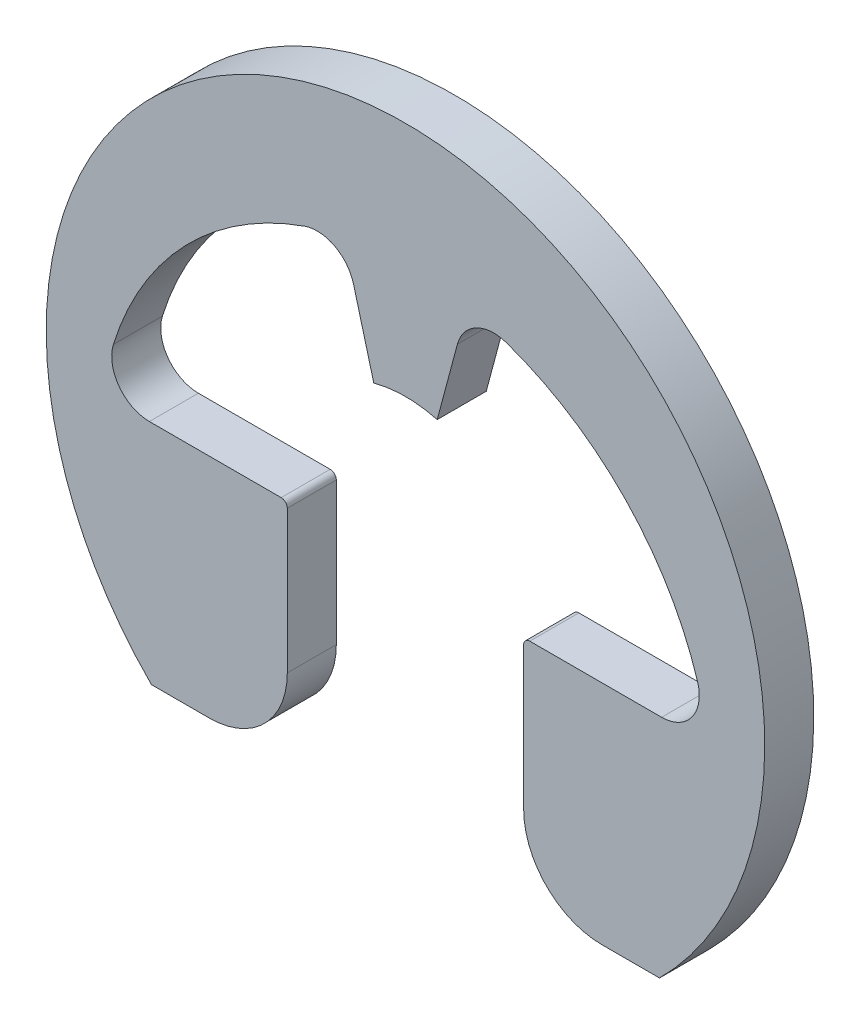
ISO-10303-21;
HEADER;
FILE_DESCRIPTION(('STEP AP214'),'2;1');
FILE_NAME('part.step','',(''),(''),'','','');
FILE_SCHEMA(('AUTOMOTIVE_DESIGN { 1 0 10303 214 1 1 1 1 }'));
ENDSEC;
DATA;
#1=APPLICATION_CONTEXT('core data for automotive mechanical design processes');
#2=APPLICATION_PROTOCOL_DEFINITION('international standard','automotive_design',2000,#1);
#3=PRODUCT_CONTEXT('',#1,'mechanical');
#4=PRODUCT('Part','Part','',(#3));
#5=PRODUCT_RELATED_PRODUCT_CATEGORY('part','',(#4));
#6=PRODUCT_DEFINITION_FORMATION('','',#4);
#7=PRODUCT_DEFINITION_CONTEXT('part definition',#1,'design');
#8=PRODUCT_DEFINITION('design','',#6,#7);
#9=PRODUCT_DEFINITION_SHAPE('','',#8);
#10=(LENGTH_UNIT() NAMED_UNIT(*) SI_UNIT(.MILLI.,.METRE.));
#11=(NAMED_UNIT(*) PLANE_ANGLE_UNIT() SI_UNIT($,.RADIAN.));
#12=(NAMED_UNIT(*) SI_UNIT($,.STERADIAN.) SOLID_ANGLE_UNIT());
#13=UNCERTAINTY_MEASURE_WITH_UNIT(LENGTH_MEASURE(1.E-05),#10,'distance_accuracy_value','');
#14=(GEOMETRIC_REPRESENTATION_CONTEXT(3) GLOBAL_UNCERTAINTY_ASSIGNED_CONTEXT((#13)) GLOBAL_UNIT_ASSIGNED_CONTEXT((#10,
#11,#12)) REPRESENTATION_CONTEXT('',''));
#15=CARTESIAN_POINT('',(0.,0.,0.));
#16=DIRECTION('',(0.,0.,1.));
#17=DIRECTION('',(1.,0.,0.));
#18=AXIS2_PLACEMENT_3D('',#15,#16,#17);
#19=CARTESIAN_POINT('',(-3.13455683202726,0.128222072929046,-0.6));
#20=DIRECTION('',(0.,0.,1.));
#21=DIRECTION('',(1.,0.,0.));
#22=AXIS2_PLACEMENT_3D('',#19,#20,#21);
#23=CYLINDRICAL_SURFACE('',#22,0.460862068965517);
#24=CARTESIAN_POINT('',(-3.13455683202726,0.128222072929046,0.));
#25=DIRECTION('',(0.,0.,-1.));
#26=DIRECTION('',(1.,0.,0.));
#27=AXIS2_PLACEMENT_3D('',#24,#25,#26);
#28=CIRCLE('',#27,0.460862068965517);
#29=CARTESIAN_POINT('',(-3.13455683202726,-0.332639996036471,0.));
#30=VERTEX_POINT('',#29);
#31=CARTESIAN_POINT('',(-3.57460913036127,0.265144756740484,0.));
#32=VERTEX_POINT('',#31);
#33=EDGE_CURVE('E201',#30,#32,#28,.T.);
#34=ORIENTED_EDGE('',*,*,#33,.F.);
#35=DIRECTION('',(0.,0.,1.));
#36=VECTOR('',#35,1.);
#37=CARTESIAN_POINT('',(-3.13455683202726,-0.332639996036471,-0.6));
#38=LINE('',#37,#36);
#39=CARTESIAN_POINT('',(-3.13455683202726,-0.332639996036471,-0.6));
#40=VERTEX_POINT('',#39);
#41=EDGE_CURVE('E11',#40,#30,#38,.T.);
#42=ORIENTED_EDGE('',*,*,#41,.F.);
#43=CARTESIAN_POINT('',(-3.13455683202726,0.128222072929046,-0.6));
#44=DIRECTION('',(0.,0.,-1.));
#45=DIRECTION('',(1.,0.,0.));
#46=AXIS2_PLACEMENT_3D('',#43,#44,#45);
#47=CIRCLE('',#46,0.460862068965517);
#48=CARTESIAN_POINT('',(-3.57460913036127,0.265144756740484,-0.6));
#49=VERTEX_POINT('',#48);
#50=EDGE_CURVE('E257',#40,#49,#47,.T.);
#51=ORIENTED_EDGE('',*,*,#50,.T.);
#52=DIRECTION('',(0.,0.,1.));
#53=VECTOR('',#52,1.);
#54=CARTESIAN_POINT('',(-3.57460913036127,0.265144756740484,-0.6));
#55=LINE('',#54,#53);
#56=EDGE_CURVE('E35',#49,#32,#55,.T.);
#57=ORIENTED_EDGE('',*,*,#56,.T.);
#58=EDGE_LOOP('',(#34,#42,#51,#57));
#59=FACE_BOUND('',#58,.T.);
#60=ADVANCED_FACE('F32',(#59),#23,.F.);
#61=CARTESIAN_POINT('',(-1.52133317640528,-0.332639996036471,-0.6));
#62=DIRECTION('',(0.,1.,0.));
#63=DIRECTION('',(-1.,0.,0.));
#64=AXIS2_PLACEMENT_3D('',#61,#62,#63);
#65=PLANE('',#64);
#66=DIRECTION('',(-1.,0.,0.));
#67=VECTOR('',#66,1.);
#68=CARTESIAN_POINT('',(-1.52133317640528,-0.332639996036471,0.));
#69=LINE('',#68,#67);
#70=CARTESIAN_POINT('',(-1.52133317640528,-0.332639996036471,0.));
#71=VERTEX_POINT('',#70);
#72=EDGE_CURVE('E255',#71,#30,#69,.T.);
#73=ORIENTED_EDGE('',*,*,#72,.F.);
#74=DIRECTION('',(0.,0.,1.));
#75=VECTOR('',#74,1.);
#76=CARTESIAN_POINT('',(-1.52133317640528,-0.332639996036471,-0.6));
#77=LINE('',#76,#75);
#78=CARTESIAN_POINT('',(-1.52133317640528,-0.332639996036471,-0.6));
#79=VERTEX_POINT('',#78);
#80=EDGE_CURVE('E41',#79,#71,#77,.T.);
#81=ORIENTED_EDGE('',*,*,#80,.F.);
#82=DIRECTION('',(-1.,0.,0.));
#83=VECTOR('',#82,1.);
#84=CARTESIAN_POINT('',(-1.52133317640528,-0.332639996036471,-0.6));
#85=LINE('',#84,#83);
#86=EDGE_CURVE('E191',#79,#40,#85,.T.);
#87=ORIENTED_EDGE('',*,*,#86,.T.);
#88=ORIENTED_EDGE('',*,*,#41,.T.);
#89=EDGE_LOOP('',(#73,#81,#87,#88));
#90=FACE_BOUND('',#89,.T.);
#91=ADVANCED_FACE('F293',(#90),#65,.T.);
#92=CARTESIAN_POINT('',(-1.52133317640528,-0.407639996036471,-0.6));
#93=DIRECTION('',(0.,0.,1.));
#94=DIRECTION('',(1.,0.,0.));
#95=AXIS2_PLACEMENT_3D('',#92,#93,#94);
#96=CYLINDRICAL_SURFACE('',#95,0.0750000000000002);
#97=CARTESIAN_POINT('',(-1.52133317640528,-0.407639996036471,0.));
#98=DIRECTION('',(0.,0.,1.));
#99=DIRECTION('',(1.,0.,0.));
#100=AXIS2_PLACEMENT_3D('',#97,#98,#99);
#101=CIRCLE('',#100,0.0750000000000002);
#102=CARTESIAN_POINT('',(-1.44633317640528,-0.407639996036471,0.));
#103=VERTEX_POINT('',#102);
#104=EDGE_CURVE('E178',#103,#71,#101,.T.);
#105=ORIENTED_EDGE('',*,*,#104,.F.);
#106=DIRECTION('',(0.,0.,1.));
#107=VECTOR('',#106,1.);
#108=CARTESIAN_POINT('',(-1.44633317640528,-0.407639996036471,-0.6));
#109=LINE('',#108,#107);
#110=CARTESIAN_POINT('',(-1.44633317640528,-0.407639996036471,-0.6));
#111=VERTEX_POINT('',#110);
#112=EDGE_CURVE('E173',#111,#103,#109,.T.);
#113=ORIENTED_EDGE('',*,*,#112,.F.);
#114=CARTESIAN_POINT('',(-1.52133317640528,-0.407639996036471,-0.6));
#115=DIRECTION('',(0.,0.,1.));
#116=DIRECTION('',(1.,0.,0.));
#117=AXIS2_PLACEMENT_3D('',#114,#115,#116);
#118=CIRCLE('',#117,0.0750000000000002);
#119=EDGE_CURVE('E176',#111,#79,#118,.T.);
#120=ORIENTED_EDGE('',*,*,#119,.T.);
#121=ORIENTED_EDGE('',*,*,#80,.T.);
#122=EDGE_LOOP('',(#105,#113,#120,#121));
#123=FACE_BOUND('',#122,.T.);
#124=ADVANCED_FACE('F175',(#123),#96,.T.);
#125=CARTESIAN_POINT('',(-1.44633317640528,-0.407639996036471,-0.6));
#126=DIRECTION('',(1.,0.,0.));
#127=DIRECTION('',(0.,0.,-1.));
#128=AXIS2_PLACEMENT_3D('',#125,#126,#127);
#129=PLANE('',#128);
#130=DIRECTION('',(0.,1.,0.));
#131=VECTOR('',#130,1.);
#132=CARTESIAN_POINT('',(-1.44633317640528,-0.407639996036471,0.));
#133=LINE('',#132,#131);
#134=CARTESIAN_POINT('',(-1.44633317640528,-2.15296946900982,0.));
#135=VERTEX_POINT('',#134);
#136=EDGE_CURVE('E252',#135,#103,#133,.T.);
#137=ORIENTED_EDGE('',*,*,#136,.F.);
#138=DIRECTION('',(0.,0.,1.));
#139=VECTOR('',#138,1.);
#140=CARTESIAN_POINT('',(-1.44633317640528,-2.15296946900982,-0.6));
#141=LINE('',#140,#139);
#142=CARTESIAN_POINT('',(-1.44633317640528,-2.15296946900982,-0.6));
#143=VERTEX_POINT('',#142);
#144=EDGE_CURVE('E183',#143,#135,#141,.T.);
#145=ORIENTED_EDGE('',*,*,#144,.F.);
#146=DIRECTION('',(0.,1.,0.));
#147=VECTOR('',#146,1.);
#148=CARTESIAN_POINT('',(-1.44633317640528,-0.407639996036471,-0.6));
#149=LINE('',#148,#147);
#150=EDGE_CURVE('E189',#143,#111,#149,.T.);
#151=ORIENTED_EDGE('',*,*,#150,.T.);
#152=ORIENTED_EDGE('',*,*,#112,.T.);
#153=EDGE_LOOP('',(#137,#145,#151,#152));
#154=FACE_BOUND('',#153,.T.);
#155=ADVANCED_FACE('F193',(#154),#129,.T.);
#156=CARTESIAN_POINT('',(-2.4021952453708,-2.15296946900982,-0.6));
#157=DIRECTION('',(0.,0.,1.));
#158=DIRECTION('',(1.,0.,0.));
#159=AXIS2_PLACEMENT_3D('',#156,#157,#158);
#160=CYLINDRICAL_SURFACE('',#159,0.955862068965517);
#161=CARTESIAN_POINT('',(-2.4021952453708,-2.15296946900982,0.));
#162=DIRECTION('',(0.,0.,1.));
#163=DIRECTION('',(1.,0.,0.));
#164=AXIS2_PLACEMENT_3D('',#161,#162,#163);
#165=CIRCLE('',#164,0.955862068965517);
#166=CARTESIAN_POINT('',(-2.4021952453708,-3.10883153797534,0.));
#167=VERTEX_POINT('',#166);
#168=EDGE_CURVE('E249',#167,#135,#165,.T.);
#169=ORIENTED_EDGE('',*,*,#168,.F.);
#170=DIRECTION('',(0.,0.,1.));
#171=VECTOR('',#170,1.);
#172=CARTESIAN_POINT('',(-2.4021952453708,-3.10883153797534,-0.6));
#173=LINE('',#172,#171);
#174=CARTESIAN_POINT('',(-2.4021952453708,-3.10883153797534,-0.6));
#175=VERTEX_POINT('',#174);
#176=EDGE_CURVE('E261',#175,#167,#173,.T.);
#177=ORIENTED_EDGE('',*,*,#176,.F.);
#178=CARTESIAN_POINT('',(-2.4021952453708,-2.15296946900982,-0.6));
#179=DIRECTION('',(0.,0.,1.));
#180=DIRECTION('',(1.,0.,0.));
#181=AXIS2_PLACEMENT_3D('',#178,#179,#180);
#182=CIRCLE('',#181,0.955862068965517);
#183=EDGE_CURVE('E194',#175,#143,#182,.T.);
#184=ORIENTED_EDGE('',*,*,#183,.T.);
#185=ORIENTED_EDGE('',*,*,#144,.T.);
#186=EDGE_LOOP('',(#169,#177,#184,#185));
#187=FACE_BOUND('',#186,.T.);
#188=ADVANCED_FACE('F306',(#187),#160,.T.);
#189=CARTESIAN_POINT('',(-2.4021952453708,-3.10883153797534,-0.6));
#190=DIRECTION('',(0.,-1.,0.));
#191=DIRECTION('',(1.,0.,0.));
#192=AXIS2_PLACEMENT_3D('',#189,#190,#191);
#193=PLANE('',#192);
#194=DIRECTION('',(1.,0.,0.));
#195=VECTOR('',#194,1.);
#196=CARTESIAN_POINT('',(-2.4021952453708,-3.10883153797534,0.));
#197=LINE('',#196,#195);
#198=CARTESIAN_POINT('',(-3.10883153797534,-3.10883153797534,0.));
#199=VERTEX_POINT('',#198);
#200=EDGE_CURVE('E246',#199,#167,#197,.T.);
#201=ORIENTED_EDGE('',*,*,#200,.F.);
#202=DIRECTION('',(0.,0.,1.));
#203=VECTOR('',#202,1.);
#204=CARTESIAN_POINT('',(-3.10883153797534,-3.10883153797534,-0.6));
#205=LINE('',#204,#203);
#206=CARTESIAN_POINT('',(-3.10883153797534,-3.10883153797534,-0.6));
#207=VERTEX_POINT('',#206);
#208=EDGE_CURVE('E263',#207,#199,#205,.T.);
#209=ORIENTED_EDGE('',*,*,#208,.F.);
#210=DIRECTION('',(1.,0.,0.));
#211=VECTOR('',#210,1.);
#212=CARTESIAN_POINT('',(-2.4021952453708,-3.10883153797534,-0.6));
#213=LINE('',#212,#211);
#214=EDGE_CURVE('E196',#207,#175,#213,.T.);
#215=ORIENTED_EDGE('',*,*,#214,.T.);
#216=ORIENTED_EDGE('',*,*,#176,.T.);
#217=EDGE_LOOP('',(#201,#209,#215,#216));
#218=FACE_BOUND('',#217,.T.);
#219=ADVANCED_FACE('F309',(#218),#193,.T.);
#220=CARTESIAN_POINT('',(0.,0.,-0.6));
#221=DIRECTION('',(0.,0.,1.));
#222=DIRECTION('',(1.,0.,0.));
#223=AXIS2_PLACEMENT_3D('',#220,#221,#222);
#224=CYLINDRICAL_SURFACE('',#223,4.39655172413793);
#225=CARTESIAN_POINT('',(0.,0.,0.));
#226=DIRECTION('',(0.,0.,1.));
#227=DIRECTION('',(1.,0.,0.));
#228=AXIS2_PLACEMENT_3D('',#225,#226,#227);
#229=CIRCLE('',#228,4.39655172413793);
#230=CARTESIAN_POINT('',(3.10883153797534,-3.10883153797534,0.));
#231=VERTEX_POINT('',#230);
#232=EDGE_CURVE('E243',#231,#199,#229,.T.);
#233=ORIENTED_EDGE('',*,*,#232,.F.);
#234=DIRECTION('',(0.,0.,1.));
#235=VECTOR('',#234,1.);
#236=CARTESIAN_POINT('',(3.10883153797534,-3.10883153797534,-0.6));
#237=LINE('',#236,#235);
#238=CARTESIAN_POINT('',(3.10883153797534,-3.10883153797534,-0.6));
#239=VERTEX_POINT('',#238);
#240=EDGE_CURVE('E265',#239,#231,#237,.T.);
#241=ORIENTED_EDGE('',*,*,#240,.F.);
#242=CARTESIAN_POINT('',(0.,0.,-0.6));
#243=DIRECTION('',(0.,0.,1.));
#244=DIRECTION('',(1.,0.,0.));
#245=AXIS2_PLACEMENT_3D('',#242,#243,#244);
#246=CIRCLE('',#245,4.39655172413793);
#247=EDGE_CURVE('E548',#239,#207,#246,.T.);
#248=ORIENTED_EDGE('',*,*,#247,.T.);
#249=ORIENTED_EDGE('',*,*,#208,.T.);
#250=EDGE_LOOP('',(#233,#241,#248,#249));
#251=FACE_BOUND('',#250,.T.);
#252=ADVANCED_FACE('F313',(#251),#224,.T.);
#253=CARTESIAN_POINT('',(3.10883153797534,-3.10883153797534,-0.6));
#254=DIRECTION('',(0.,-1.,0.));
#255=DIRECTION('',(0.,0.,-1.));
#256=AXIS2_PLACEMENT_3D('',#253,#254,#255);
#257=PLANE('',#256);
#258=DIRECTION('',(1.,0.,0.));
#259=VECTOR('',#258,1.);
#260=CARTESIAN_POINT('',(3.10883153797534,-3.10883153797534,0.));
#261=LINE('',#260,#259);
#262=CARTESIAN_POINT('',(2.4021952453708,-3.10883153797534,0.));
#263=VERTEX_POINT('',#262);
#264=EDGE_CURVE('E240',#263,#231,#261,.T.);
#265=ORIENTED_EDGE('',*,*,#264,.F.);
#266=DIRECTION('',(0.,0.,1.));
#267=VECTOR('',#266,1.);
#268=CARTESIAN_POINT('',(2.4021952453708,-3.10883153797534,-0.6));
#269=LINE('',#268,#267);
#270=CARTESIAN_POINT('',(2.4021952453708,-3.10883153797534,-0.6));
#271=VERTEX_POINT('',#270);
#272=EDGE_CURVE('E267',#271,#263,#269,.T.);
#273=ORIENTED_EDGE('',*,*,#272,.F.);
#274=DIRECTION('',(1.,0.,0.));
#275=VECTOR('',#274,1.);
#276=CARTESIAN_POINT('',(3.10883153797534,-3.10883153797534,-0.6));
#277=LINE('',#276,#275);
#278=EDGE_CURVE('E541',#271,#239,#277,.T.);
#279=ORIENTED_EDGE('',*,*,#278,.T.);
#280=ORIENTED_EDGE('',*,*,#240,.T.);
#281=EDGE_LOOP('',(#265,#273,#279,#280));
#282=FACE_BOUND('',#281,.T.);
#283=ADVANCED_FACE('F317',(#282),#257,.T.);
#284=CARTESIAN_POINT('',(2.4021952453708,-2.15296946900982,-0.6));
#285=DIRECTION('',(0.,0.,1.));
#286=DIRECTION('',(1.,0.,0.));
#287=AXIS2_PLACEMENT_3D('',#284,#285,#286);
#288=CYLINDRICAL_SURFACE('',#287,0.955862068965517);
#289=CARTESIAN_POINT('',(2.4021952453708,-2.15296946900982,0.));
#290=DIRECTION('',(0.,0.,1.));
#291=DIRECTION('',(1.,0.,0.));
#292=AXIS2_PLACEMENT_3D('',#289,#290,#291);
#293=CIRCLE('',#292,0.955862068965517);
#294=CARTESIAN_POINT('',(1.44633317640528,-2.15296946900982,0.));
#295=VERTEX_POINT('',#294);
#296=EDGE_CURVE('E237',#295,#263,#293,.T.);
#297=ORIENTED_EDGE('',*,*,#296,.F.);
#298=DIRECTION('',(0.,0.,1.));
#299=VECTOR('',#298,1.);
#300=CARTESIAN_POINT('',(1.44633317640528,-2.15296946900982,-0.6));
#301=LINE('',#300,#299);
#302=CARTESIAN_POINT('',(1.44633317640528,-2.15296946900982,-0.6));
#303=VERTEX_POINT('',#302);
#304=EDGE_CURVE('E269',#303,#295,#301,.T.);
#305=ORIENTED_EDGE('',*,*,#304,.F.);
#306=CARTESIAN_POINT('',(2.4021952453708,-2.15296946900982,-0.6));
#307=DIRECTION('',(0.,0.,1.));
#308=DIRECTION('',(1.,0.,0.));
#309=AXIS2_PLACEMENT_3D('',#306,#307,#308);
#310=CIRCLE('',#309,0.955862068965517);
#311=EDGE_CURVE('E537',#303,#271,#310,.T.);
#312=ORIENTED_EDGE('',*,*,#311,.T.);
#313=ORIENTED_EDGE('',*,*,#272,.T.);
#314=EDGE_LOOP('',(#297,#305,#312,#313));
#315=FACE_BOUND('',#314,.T.);
#316=ADVANCED_FACE('F321',(#315),#288,.T.);
#317=CARTESIAN_POINT('',(1.44633317640528,-0.407639996036471,-0.6));
#318=DIRECTION('',(-1.,0.,0.));
#319=DIRECTION('',(0.,0.,1.));
#320=AXIS2_PLACEMENT_3D('',#317,#318,#319);
#321=PLANE('',#320);
#322=DIRECTION('',(0.,-1.,0.));
#323=VECTOR('',#322,1.);
#324=CARTESIAN_POINT('',(1.44633317640528,-0.407639996036471,0.));
#325=LINE('',#324,#323);
#326=CARTESIAN_POINT('',(1.44633317640528,-0.407639996036471,0.));
#327=VERTEX_POINT('',#326);
#328=EDGE_CURVE('E234',#327,#295,#325,.T.);
#329=ORIENTED_EDGE('',*,*,#328,.F.);
#330=DIRECTION('',(0.,0.,1.));
#331=VECTOR('',#330,1.);
#332=CARTESIAN_POINT('',(1.44633317640528,-0.407639996036471,-0.6));
#333=LINE('',#332,#331);
#334=CARTESIAN_POINT('',(1.44633317640528,-0.407639996036471,-0.6));
#335=VERTEX_POINT('',#334);
#336=EDGE_CURVE('E271',#335,#327,#333,.T.);
#337=ORIENTED_EDGE('',*,*,#336,.F.);
#338=DIRECTION('',(0.,-1.,0.));
#339=VECTOR('',#338,1.);
#340=CARTESIAN_POINT('',(1.44633317640528,-0.407639996036471,-0.6));
#341=LINE('',#340,#339);
#342=EDGE_CURVE('E553',#335,#303,#341,.T.);
#343=ORIENTED_EDGE('',*,*,#342,.T.);
#344=ORIENTED_EDGE('',*,*,#304,.T.);
#345=EDGE_LOOP('',(#329,#337,#343,#344));
#346=FACE_BOUND('',#345,.T.);
#347=ADVANCED_FACE('F325',(#346),#321,.T.);
#348=CARTESIAN_POINT('',(1.52133317640528,-0.407639996036471,-0.6));
#349=DIRECTION('',(0.,0.,1.));
#350=DIRECTION('',(1.,0.,0.));
#351=AXIS2_PLACEMENT_3D('',#348,#349,#350);
#352=CYLINDRICAL_SURFACE('',#351,0.0750000000000002);
#353=CARTESIAN_POINT('',(1.52133317640528,-0.407639996036471,0.));
#354=DIRECTION('',(0.,0.,1.));
#355=DIRECTION('',(1.,0.,0.));
#356=AXIS2_PLACEMENT_3D('',#353,#354,#355);
#357=CIRCLE('',#356,0.0750000000000002);
#358=CARTESIAN_POINT('',(1.52133317640528,-0.332639996036471,0.));
#359=VERTEX_POINT('',#358);
#360=EDGE_CURVE('E231',#359,#327,#357,.T.);
#361=ORIENTED_EDGE('',*,*,#360,.F.);
#362=DIRECTION('',(0.,0.,1.));
#363=VECTOR('',#362,1.);
#364=CARTESIAN_POINT('',(1.52133317640528,-0.332639996036471,-0.6));
#365=LINE('',#364,#363);
#366=CARTESIAN_POINT('',(1.52133317640528,-0.332639996036471,-0.6));
#367=VERTEX_POINT('',#366);
#368=EDGE_CURVE('E273',#367,#359,#365,.T.);
#369=ORIENTED_EDGE('',*,*,#368,.F.);
#370=CARTESIAN_POINT('',(1.52133317640528,-0.407639996036471,-0.6));
#371=DIRECTION('',(0.,0.,1.));
#372=DIRECTION('',(1.,0.,0.));
#373=AXIS2_PLACEMENT_3D('',#370,#371,#372);
#374=CIRCLE('',#373,0.0750000000000002);
#375=EDGE_CURVE('E530',#367,#335,#374,.T.);
#376=ORIENTED_EDGE('',*,*,#375,.T.);
#377=ORIENTED_EDGE('',*,*,#336,.T.);
#378=EDGE_LOOP('',(#361,#369,#376,#377));
#379=FACE_BOUND('',#378,.T.);
#380=ADVANCED_FACE('F329',(#379),#352,.T.);
#381=CARTESIAN_POINT('',(1.52133317640528,-0.332639996036471,-0.6));
#382=DIRECTION('',(0.,1.,0.));
#383=DIRECTION('',(0.,0.,1.));
#384=AXIS2_PLACEMENT_3D('',#381,#382,#383);
#385=PLANE('',#384);
#386=DIRECTION('',(-1.,0.,0.));
#387=VECTOR('',#386,1.);
#388=CARTESIAN_POINT('',(1.52133317640528,-0.332639996036471,0.));
#389=LINE('',#388,#387);
#390=CARTESIAN_POINT('',(3.13455683202726,-0.332639996036471,0.));
#391=VERTEX_POINT('',#390);
#392=EDGE_CURVE('E228',#391,#359,#389,.T.);
#393=ORIENTED_EDGE('',*,*,#392,.F.);
#394=DIRECTION('',(0.,0.,1.));
#395=VECTOR('',#394,1.);
#396=CARTESIAN_POINT('',(3.13455683202726,-0.332639996036471,-0.6));
#397=LINE('',#396,#395);
#398=CARTESIAN_POINT('',(3.13455683202726,-0.332639996036471,-0.6));
#399=VERTEX_POINT('',#398);
#400=EDGE_CURVE('E275',#399,#391,#397,.T.);
#401=ORIENTED_EDGE('',*,*,#400,.F.);
#402=DIRECTION('',(-1.,0.,0.));
#403=VECTOR('',#402,1.);
#404=CARTESIAN_POINT('',(1.52133317640528,-0.332639996036471,-0.6));
#405=LINE('',#404,#403);
#406=EDGE_CURVE('E526',#399,#367,#405,.T.);
#407=ORIENTED_EDGE('',*,*,#406,.T.);
#408=ORIENTED_EDGE('',*,*,#368,.T.);
#409=EDGE_LOOP('',(#393,#401,#407,#408));
#410=FACE_BOUND('',#409,.T.);
#411=ADVANCED_FACE('F333',(#410),#385,.T.);
#412=CARTESIAN_POINT('',(3.13455683202726,0.128222072929046,-0.6));
#413=DIRECTION('',(0.,0.,1.));
#414=DIRECTION('',(1.,0.,0.));
#415=AXIS2_PLACEMENT_3D('',#412,#413,#414);
#416=CYLINDRICAL_SURFACE('',#415,0.460862068965517);
#417=CARTESIAN_POINT('',(3.13455683202726,0.128222072929046,0.));
#418=DIRECTION('',(0.,0.,-1.));
#419=DIRECTION('',(1.,0.,0.));
#420=AXIS2_PLACEMENT_3D('',#417,#418,#419);
#421=CIRCLE('',#420,0.460862068965517);
#422=CARTESIAN_POINT('',(3.57460913036127,0.265144756740484,0.));
#423=VERTEX_POINT('',#422);
#424=EDGE_CURVE('E225',#423,#391,#421,.T.);
#425=ORIENTED_EDGE('',*,*,#424,.F.);
#426=DIRECTION('',(0.,0.,1.));
#427=VECTOR('',#426,1.);
#428=CARTESIAN_POINT('',(3.57460913036127,0.265144756740484,-0.6));
#429=LINE('',#428,#427);
#430=CARTESIAN_POINT('',(3.57460913036127,0.265144756740484,-0.6));
#431=VERTEX_POINT('',#430);
#432=EDGE_CURVE('E277',#431,#423,#429,.T.);
#433=ORIENTED_EDGE('',*,*,#432,.F.);
#434=CARTESIAN_POINT('',(3.13455683202726,0.128222072929046,-0.6));
#435=DIRECTION('',(0.,0.,-1.));
#436=DIRECTION('',(1.,0.,0.));
#437=AXIS2_PLACEMENT_3D('',#434,#435,#436);
#438=CIRCLE('',#437,0.460862068965517);
#439=EDGE_CURVE('E557',#431,#399,#438,.T.);
#440=ORIENTED_EDGE('',*,*,#439,.T.);
#441=ORIENTED_EDGE('',*,*,#400,.T.);
#442=EDGE_LOOP('',(#425,#433,#440,#441));
#443=FACE_BOUND('',#442,.T.);
#444=ADVANCED_FACE('F337',(#443),#416,.F.);
#445=CARTESIAN_POINT('',(0.,-0.847098214285715,-0.6));
#446=DIRECTION('',(0.,0.,1.));
#447=DIRECTION('',(1.,0.,0.));
#448=AXIS2_PLACEMENT_3D('',#445,#446,#447);
#449=CYLINDRICAL_SURFACE('',#448,3.74364993842365);
#450=CARTESIAN_POINT('',(0.,-0.847098214285715,0.));
#451=DIRECTION('',(0.,0.,-1.));
#452=DIRECTION('',(-1.,0.,0.));
#453=AXIS2_PLACEMENT_3D('',#450,#451,#452);
#454=CIRCLE('',#453,3.74364993842365);
#455=CARTESIAN_POINT('',(1.23244813374784,2.68786804567786,0.));
#456=VERTEX_POINT('',#455);
#457=EDGE_CURVE('E222',#456,#423,#454,.T.);
#458=ORIENTED_EDGE('',*,*,#457,.F.);
#459=DIRECTION('',(0.,0.,1.));
#460=VECTOR('',#459,1.);
#461=CARTESIAN_POINT('',(1.23244813374784,2.68786804567786,-0.6));
#462=LINE('',#461,#460);
#463=CARTESIAN_POINT('',(1.23244813374784,2.68786804567786,-0.6));
#464=VERTEX_POINT('',#463);
#465=EDGE_CURVE('E279',#464,#456,#462,.T.);
#466=ORIENTED_EDGE('',*,*,#465,.F.);
#467=CARTESIAN_POINT('',(0.,-0.847098214285715,-0.6));
#468=DIRECTION('',(0.,0.,-1.));
#469=DIRECTION('',(-1.,0.,0.));
#470=AXIS2_PLACEMENT_3D('',#467,#468,#469);
#471=CIRCLE('',#470,3.74364993842365);
#472=EDGE_CURVE('E519',#464,#431,#471,.T.);
#473=ORIENTED_EDGE('',*,*,#472,.T.);
#474=ORIENTED_EDGE('',*,*,#432,.T.);
#475=EDGE_LOOP('',(#458,#466,#473,#474));
#476=FACE_BOUND('',#475,.T.);
#477=ADVANCED_FACE('F341',(#476),#449,.F.);
#478=CARTESIAN_POINT('',(1.08072759198936,2.25269598336263,-0.6));
#479=DIRECTION('',(0.,0.,1.));
#480=DIRECTION('',(1.,0.,0.));
#481=AXIS2_PLACEMENT_3D('',#478,#479,#480);
#482=CYLINDRICAL_SURFACE('',#481,0.460862068965518);
#483=CARTESIAN_POINT('',(1.08072759198936,2.25269598336263,0.));
#484=DIRECTION('',(0.,0.,-1.));
#485=DIRECTION('',(1.,0.,0.));
#486=AXIS2_PLACEMENT_3D('',#483,#484,#485);
#487=CIRCLE('',#486,0.460862068965518);
#488=CARTESIAN_POINT('',(0.635569017218553,2.37197586397625,0.));
#489=VERTEX_POINT('',#488);
#490=EDGE_CURVE('E219',#489,#456,#487,.T.);
#491=ORIENTED_EDGE('',*,*,#490,.F.);
#492=DIRECTION('',(0.,0.,1.));
#493=VECTOR('',#492,1.);
#494=CARTESIAN_POINT('',(0.635569017218553,2.37197586397625,-0.6));
#495=LINE('',#494,#493);
#496=CARTESIAN_POINT('',(0.635569017218553,2.37197586397625,-0.6));
#497=VERTEX_POINT('',#496);
#498=EDGE_CURVE('E281',#497,#489,#495,.T.);
#499=ORIENTED_EDGE('',*,*,#498,.F.);
#500=CARTESIAN_POINT('',(1.08072759198936,2.25269598336263,-0.6));
#501=DIRECTION('',(0.,0.,-1.));
#502=DIRECTION('',(1.,0.,0.));
#503=AXIS2_PLACEMENT_3D('',#500,#501,#502);
#504=CIRCLE('',#503,0.460862068965518);
#505=EDGE_CURVE('E515',#497,#464,#504,.T.);
#506=ORIENTED_EDGE('',*,*,#505,.T.);
#507=ORIENTED_EDGE('',*,*,#465,.T.);
#508=EDGE_LOOP('',(#491,#499,#506,#507));
#509=FACE_BOUND('',#508,.T.);
#510=ADVANCED_FACE('F345',(#509),#482,.F.);
#511=CARTESIAN_POINT('',(0.635569017218553,2.37197586397625,-0.6));
#512=DIRECTION('',(0.965925826289068,-0.258819045102521,0.));
#513=DIRECTION('',(0.258819045102521,0.965925826289068,0.));
#514=AXIS2_PLACEMENT_3D('',#511,#512,#513);
#515=PLANE('',#514);
#516=DIRECTION('',(0.258819045102522,0.965925826289068,0.));
#517=VECTOR('',#516,1.);
#518=CARTESIAN_POINT('',(0.635569017218553,2.37197586397625,0.));
#519=LINE('',#518,#517);
#520=CARTESIAN_POINT('',(0.388228567653782,1.4488887394336,0.));
#521=VERTEX_POINT('',#520);
#522=EDGE_CURVE('E216',#521,#489,#519,.T.);
#523=ORIENTED_EDGE('',*,*,#522,.F.);
#524=DIRECTION('',(0.,0.,1.));
#525=VECTOR('',#524,1.);
#526=CARTESIAN_POINT('',(0.388228567653782,1.4488887394336,-0.6));
#527=LINE('',#526,#525);
#528=CARTESIAN_POINT('',(0.388228567653782,1.4488887394336,-0.6));
#529=VERTEX_POINT('',#528);
#530=EDGE_CURVE('E283',#529,#521,#527,.T.);
#531=ORIENTED_EDGE('',*,*,#530,.F.);
#532=DIRECTION('',(0.258819045102522,0.965925826289068,0.));
#533=VECTOR('',#532,1.);
#534=CARTESIAN_POINT('',(0.635569017218553,2.37197586397625,-0.6));
#535=LINE('',#534,#533);
#536=EDGE_CURVE('E561',#529,#497,#535,.T.);
#537=ORIENTED_EDGE('',*,*,#536,.T.);
#538=ORIENTED_EDGE('',*,*,#498,.T.);
#539=EDGE_LOOP('',(#523,#531,#537,#538));
#540=FACE_BOUND('',#539,.T.);
#541=ADVANCED_FACE('F349',(#540),#515,.T.);
#542=CARTESIAN_POINT('',(0.,0.,-0.6));
#543=DIRECTION('',(0.,0.,1.));
#544=DIRECTION('',(1.,0.,0.));
#545=AXIS2_PLACEMENT_3D('',#542,#543,#544);
#546=CYLINDRICAL_SURFACE('',#545,1.5);
#547=CARTESIAN_POINT('',(0.,0.,0.));
#548=DIRECTION('',(0.,0.,-1.));
#549=DIRECTION('',(-1.,0.,0.));
#550=AXIS2_PLACEMENT_3D('',#547,#548,#549);
#551=CIRCLE('',#550,1.5);
#552=CARTESIAN_POINT('',(-0.388228567653782,1.4488887394336,0.));
#553=VERTEX_POINT('',#552);
#554=EDGE_CURVE('E213',#553,#521,#551,.T.);
#555=ORIENTED_EDGE('',*,*,#554,.F.);
#556=DIRECTION('',(0.,0.,1.));
#557=VECTOR('',#556,1.);
#558=CARTESIAN_POINT('',(-0.388228567653782,1.4488887394336,-0.6));
#559=LINE('',#558,#557);
#560=CARTESIAN_POINT('',(-0.388228567653782,1.4488887394336,-0.6));
#561=VERTEX_POINT('',#560);
#562=EDGE_CURVE('E285',#561,#553,#559,.T.);
#563=ORIENTED_EDGE('',*,*,#562,.F.);
#564=CARTESIAN_POINT('',(0.,0.,-0.6));
#565=DIRECTION('',(0.,0.,-1.));
#566=DIRECTION('',(-1.,0.,0.));
#567=AXIS2_PLACEMENT_3D('',#564,#565,#566);
#568=CIRCLE('',#567,1.5);
#569=EDGE_CURVE('E508',#561,#529,#568,.T.);
#570=ORIENTED_EDGE('',*,*,#569,.T.);
#571=ORIENTED_EDGE('',*,*,#530,.T.);
#572=EDGE_LOOP('',(#555,#563,#570,#571));
#573=FACE_BOUND('',#572,.T.);
#574=ADVANCED_FACE('F353',(#573),#546,.F.);
#575=CARTESIAN_POINT('',(-0.635569017218553,2.37197586397625,-0.6));
#576=DIRECTION('',(-0.965925826289068,-0.258819045102521,0.));
#577=DIRECTION('',(0.258819045102521,-0.965925826289068,0.));
#578=AXIS2_PLACEMENT_3D('',#575,#576,#577);
#579=PLANE('',#578);
#580=DIRECTION('',(0.258819045102522,-0.965925826289068,0.));
#581=VECTOR('',#580,1.);
#582=CARTESIAN_POINT('',(-0.635569017218553,2.37197586397625,0.));
#583=LINE('',#582,#581);
#584=CARTESIAN_POINT('',(-0.635569017218553,2.37197586397625,0.));
#585=VERTEX_POINT('',#584);
#586=EDGE_CURVE('E210',#585,#553,#583,.T.);
#587=ORIENTED_EDGE('',*,*,#586,.F.);
#588=DIRECTION('',(0.,0.,1.));
#589=VECTOR('',#588,1.);
#590=CARTESIAN_POINT('',(-0.635569017218553,2.37197586397625,-0.6));
#591=LINE('',#590,#589);
#592=CARTESIAN_POINT('',(-0.635569017218553,2.37197586397625,-0.6));
#593=VERTEX_POINT('',#592);
#594=EDGE_CURVE('E287',#593,#585,#591,.T.);
#595=ORIENTED_EDGE('',*,*,#594,.F.);
#596=DIRECTION('',(0.258819045102522,-0.965925826289068,0.));
#597=VECTOR('',#596,1.);
#598=CARTESIAN_POINT('',(-0.635569017218553,2.37197586397625,-0.6));
#599=LINE('',#598,#597);
#600=EDGE_CURVE('E504',#593,#561,#599,.T.);
#601=ORIENTED_EDGE('',*,*,#600,.T.);
#602=ORIENTED_EDGE('',*,*,#562,.T.);
#603=EDGE_LOOP('',(#587,#595,#601,#602));
#604=FACE_BOUND('',#603,.T.);
#605=ADVANCED_FACE('F357',(#604),#579,.T.);
#606=CARTESIAN_POINT('',(-1.08072759198936,2.25269598336263,-0.6));
#607=DIRECTION('',(0.,0.,1.));
#608=DIRECTION('',(1.,0.,0.));
#609=AXIS2_PLACEMENT_3D('',#606,#607,#608);
#610=CYLINDRICAL_SURFACE('',#609,0.460862068965518);
#611=CARTESIAN_POINT('',(-1.08072759198936,2.25269598336263,0.));
#612=DIRECTION('',(0.,0.,-1.));
#613=DIRECTION('',(1.,0.,0.));
#614=AXIS2_PLACEMENT_3D('',#611,#612,#613);
#615=CIRCLE('',#614,0.460862068965518);
#616=CARTESIAN_POINT('',(-1.23244813374784,2.68786804567786,0.));
#617=VERTEX_POINT('',#616);
#618=EDGE_CURVE('E207',#617,#585,#615,.T.);
#619=ORIENTED_EDGE('',*,*,#618,.F.);
#620=DIRECTION('',(0.,0.,1.));
#621=VECTOR('',#620,1.);
#622=CARTESIAN_POINT('',(-1.23244813374784,2.68786804567786,-0.6));
#623=LINE('',#622,#621);
#624=CARTESIAN_POINT('',(-1.23244813374784,2.68786804567786,-0.6));
#625=VERTEX_POINT('',#624);
#626=EDGE_CURVE('E288',#625,#617,#623,.T.);
#627=ORIENTED_EDGE('',*,*,#626,.F.);
#628=CARTESIAN_POINT('',(-1.08072759198936,2.25269598336263,-0.6));
#629=DIRECTION('',(0.,0.,-1.));
#630=DIRECTION('',(1.,0.,0.));
#631=AXIS2_PLACEMENT_3D('',#628,#629,#630);
#632=CIRCLE('',#631,0.460862068965518);
#633=EDGE_CURVE('E565',#625,#593,#632,.T.);
#634=ORIENTED_EDGE('',*,*,#633,.T.);
#635=ORIENTED_EDGE('',*,*,#594,.T.);
#636=EDGE_LOOP('',(#619,#627,#634,#635));
#637=FACE_BOUND('',#636,.T.);
#638=ADVANCED_FACE('F361',(#637),#610,.F.);
#639=CARTESIAN_POINT('',(0.,-0.847098214285715,-0.6));
#640=DIRECTION('',(0.,0.,1.));
#641=DIRECTION('',(1.,0.,0.));
#642=AXIS2_PLACEMENT_3D('',#639,#640,#641);
#643=CYLINDRICAL_SURFACE('',#642,3.74364993842365);
#644=CARTESIAN_POINT('',(0.,-0.847098214285715,0.));
#645=DIRECTION('',(0.,0.,-1.));
#646=DIRECTION('',(-1.,0.,0.));
#647=AXIS2_PLACEMENT_3D('',#644,#645,#646);
#648=CIRCLE('',#647,3.74364993842365);
#649=EDGE_CURVE('E204',#32,#617,#648,.T.);
#650=ORIENTED_EDGE('',*,*,#649,.F.);
#651=ORIENTED_EDGE('',*,*,#56,.F.);
#652=CARTESIAN_POINT('',(0.,-0.847098214285715,-0.6));
#653=DIRECTION('',(0.,0.,-1.));
#654=DIRECTION('',(-1.,0.,0.));
#655=AXIS2_PLACEMENT_3D('',#652,#653,#654);
#656=CIRCLE('',#655,3.74364993842365);
#657=EDGE_CURVE('E567',#49,#625,#656,.T.);
#658=ORIENTED_EDGE('',*,*,#657,.T.);
#659=ORIENTED_EDGE('',*,*,#626,.T.);
#660=EDGE_LOOP('',(#650,#651,#658,#659));
#661=FACE_BOUND('',#660,.T.);
#662=ADVANCED_FACE('F290',(#661),#643,.F.);
#663=CARTESIAN_POINT('',(-3.13455683202726,0.128222072929046,-0.6));
#664=DIRECTION('',(0.,0.,1.));
#665=DIRECTION('',(1.,0.,0.));
#666=AXIS2_PLACEMENT_3D('',#663,#664,#665);
#667=PLANE('',#666);
#668=ORIENTED_EDGE('',*,*,#50,.F.);
#669=ORIENTED_EDGE('',*,*,#86,.F.);
#670=ORIENTED_EDGE('',*,*,#119,.F.);
#671=ORIENTED_EDGE('',*,*,#150,.F.);
#672=ORIENTED_EDGE('',*,*,#183,.F.);
#673=ORIENTED_EDGE('',*,*,#214,.F.);
#674=ORIENTED_EDGE('',*,*,#247,.F.);
#675=ORIENTED_EDGE('',*,*,#278,.F.);
#676=ORIENTED_EDGE('',*,*,#311,.F.);
#677=ORIENTED_EDGE('',*,*,#342,.F.);
#678=ORIENTED_EDGE('',*,*,#375,.F.);
#679=ORIENTED_EDGE('',*,*,#406,.F.);
#680=ORIENTED_EDGE('',*,*,#439,.F.);
#681=ORIENTED_EDGE('',*,*,#472,.F.);
#682=ORIENTED_EDGE('',*,*,#505,.F.);
#683=ORIENTED_EDGE('',*,*,#536,.F.);
#684=ORIENTED_EDGE('',*,*,#569,.F.);
#685=ORIENTED_EDGE('',*,*,#600,.F.);
#686=ORIENTED_EDGE('',*,*,#633,.F.);
#687=ORIENTED_EDGE('',*,*,#657,.F.);
#688=EDGE_LOOP('',(#668,#669,#670,#671,#672,#673,#674,#675,#676,#677,#678,#679,#680,#681,#682,
#683,#684,#685,#686,#687));
#689=FACE_BOUND('',#688,.T.);
#690=ADVANCED_FACE('F187',(#689),#667,.F.);
#691=CARTESIAN_POINT('',(-3.13455683202726,0.128222072929046,0.));
#692=DIRECTION('',(0.,0.,1.));
#693=DIRECTION('',(1.,0.,0.));
#694=AXIS2_PLACEMENT_3D('',#691,#692,#693);
#695=PLANE('',#694);
#696=ORIENTED_EDGE('',*,*,#33,.T.);
#697=ORIENTED_EDGE('',*,*,#649,.T.);
#698=ORIENTED_EDGE('',*,*,#618,.T.);
#699=ORIENTED_EDGE('',*,*,#586,.T.);
#700=ORIENTED_EDGE('',*,*,#554,.T.);
#701=ORIENTED_EDGE('',*,*,#522,.T.);
#702=ORIENTED_EDGE('',*,*,#490,.T.);
#703=ORIENTED_EDGE('',*,*,#457,.T.);
#704=ORIENTED_EDGE('',*,*,#424,.T.);
#705=ORIENTED_EDGE('',*,*,#392,.T.);
#706=ORIENTED_EDGE('',*,*,#360,.T.);
#707=ORIENTED_EDGE('',*,*,#328,.T.);
#708=ORIENTED_EDGE('',*,*,#296,.T.);
#709=ORIENTED_EDGE('',*,*,#264,.T.);
#710=ORIENTED_EDGE('',*,*,#232,.T.);
#711=ORIENTED_EDGE('',*,*,#200,.T.);
#712=ORIENTED_EDGE('',*,*,#168,.T.);
#713=ORIENTED_EDGE('',*,*,#136,.T.);
#714=ORIENTED_EDGE('',*,*,#104,.T.);
#715=ORIENTED_EDGE('',*,*,#72,.T.);
#716=EDGE_LOOP('',(#696,#697,#698,#699,#700,#701,#702,#703,#704,#705,#706,#707,#708,#709,#710,
#711,#712,#713,#714,#715));
#717=FACE_BOUND('',#716,.T.);
#718=ADVANCED_FACE('F292',(#717),#695,.T.);
#719=CLOSED_SHELL('',(#60,#91,#124,#155,#188,#219,#252,#283,#316,#347,#380,#411,#444,#477,#510,
#541,#574,#605,#638,#662,#690,#718));
#720=MANIFOLD_SOLID_BREP('B2',#719);
#721=ADVANCED_BREP_SHAPE_REPRESENTATION('',(#18,#720),#14);
#722=SHAPE_DEFINITION_REPRESENTATION(#9,#721);
ENDSEC;
END-ISO-10303-21;
